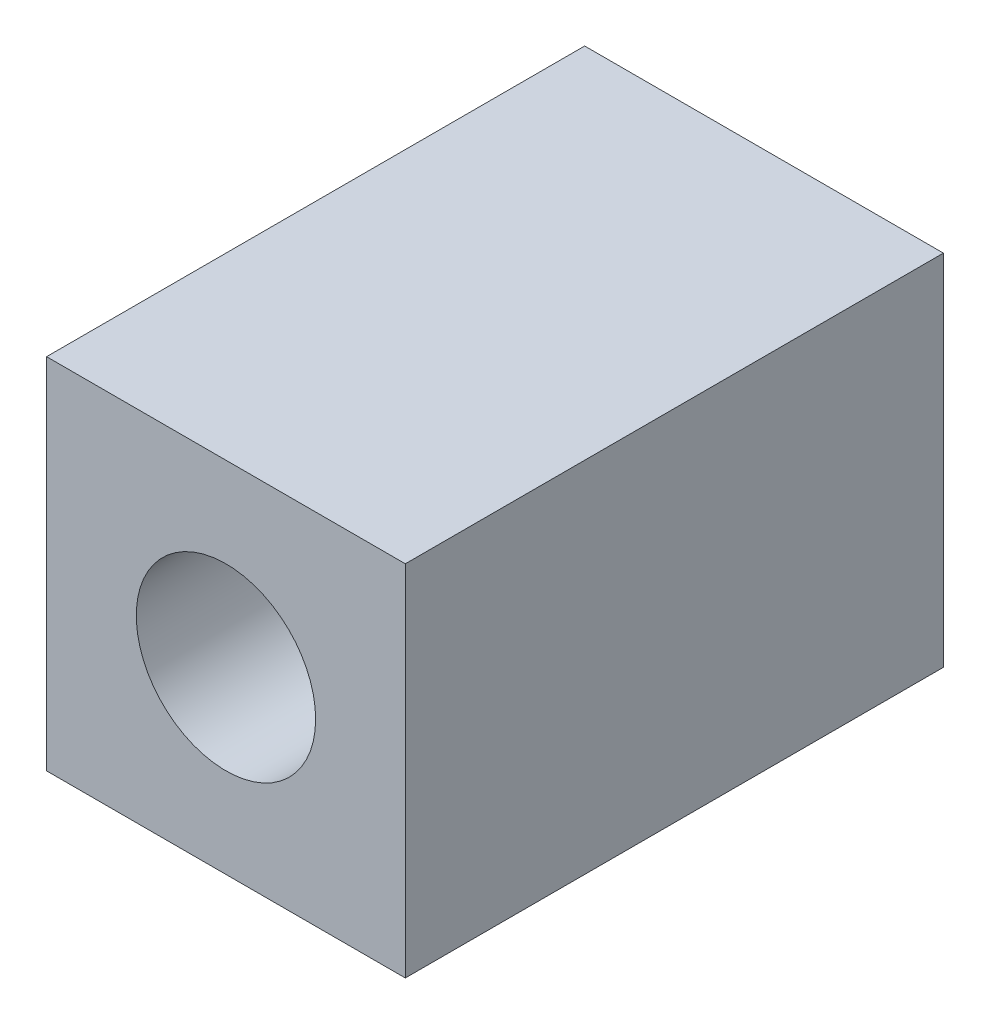
ISO-10303-21;
HEADER;
FILE_DESCRIPTION(('STEP AP214'),'2;1');
FILE_NAME('part.step','',(''),(''),'','','');
FILE_SCHEMA(('AUTOMOTIVE_DESIGN { 1 0 10303 214 1 1 1 1 }'));
ENDSEC;
DATA;
#1=APPLICATION_CONTEXT('core data for automotive mechanical design processes');
#2=APPLICATION_PROTOCOL_DEFINITION('international standard','automotive_design',2000,#1);
#3=PRODUCT_CONTEXT('',#1,'mechanical');
#4=PRODUCT('Part','Part','',(#3));
#5=PRODUCT_RELATED_PRODUCT_CATEGORY('part','',(#4));
#6=PRODUCT_DEFINITION_FORMATION('','',#4);
#7=PRODUCT_DEFINITION_CONTEXT('part definition',#1,'design');
#8=PRODUCT_DEFINITION('design','',#6,#7);
#9=PRODUCT_DEFINITION_SHAPE('','',#8);
#10=(LENGTH_UNIT() NAMED_UNIT(*) SI_UNIT(.MILLI.,.METRE.));
#11=(NAMED_UNIT(*) PLANE_ANGLE_UNIT() SI_UNIT($,.RADIAN.));
#12=(NAMED_UNIT(*) SI_UNIT($,.STERADIAN.) SOLID_ANGLE_UNIT());
#13=UNCERTAINTY_MEASURE_WITH_UNIT(LENGTH_MEASURE(1.E-05),#10,'distance_accuracy_value','');
#14=(GEOMETRIC_REPRESENTATION_CONTEXT(3) GLOBAL_UNCERTAINTY_ASSIGNED_CONTEXT((#13)) GLOBAL_UNIT_ASSIGNED_CONTEXT((#10,
#11,#12)) REPRESENTATION_CONTEXT('',''));
#15=CARTESIAN_POINT('',(0.,0.,0.));
#16=DIRECTION('',(0.,0.,1.));
#17=DIRECTION('',(1.,0.,0.));
#18=AXIS2_PLACEMENT_3D('',#15,#16,#17);
#19=CARTESIAN_POINT('',(-5.0000000000005,-5.00000000000061,15.0000000000003));
#20=DIRECTION('',(0.,0.,-1.00000000000001));
#21=DIRECTION('',(-1.00000000000001,0.,0.));
#22=AXIS2_PLACEMENT_3D('',#19,#20,#21);
#23=PLANE('',#22);
#24=DIRECTION('',(0.,-1.,0.));
#25=VECTOR('',#24,1.);
#26=CARTESIAN_POINT('',(-5.0000000000005,-5.00000000000061,15.0000000000003));
#27=LINE('',#26,#25);
#28=CARTESIAN_POINT('',(-5.,5.00000000000039,15.0000000000005));
#29=VERTEX_POINT('',#28);
#30=CARTESIAN_POINT('',(-5.0000000000005,-5.00000000000061,15.0000000000003));
#31=VERTEX_POINT('',#30);
#32=EDGE_CURVE('E95',#29,#31,#27,.T.);
#33=ORIENTED_EDGE('',*,*,#32,.T.);
#34=DIRECTION('',(1.00000000000001,0.,0.));
#35=VECTOR('',#34,1.);
#36=CARTESIAN_POINT('',(-5.0000000000005,-5.00000000000061,15.0000000000003));
#37=LINE('',#36,#35);
#38=CARTESIAN_POINT('',(5.00000000000014,-4.99999999999959,15.0000000000002));
#39=VERTEX_POINT('',#38);
#40=EDGE_CURVE('E98',#31,#39,#37,.T.);
#41=ORIENTED_EDGE('',*,*,#40,.T.);
#42=DIRECTION('',(0.,1.,0.));
#43=VECTOR('',#42,1.);
#44=CARTESIAN_POINT('',(5.00000000000014,-4.99999999999959,15.0000000000002));
#45=LINE('',#44,#43);
#46=CARTESIAN_POINT('',(4.99999999999923,5.00000000000042,15.0000000000005));
#47=VERTEX_POINT('',#46);
#48=EDGE_CURVE('E100',#39,#47,#45,.T.);
#49=ORIENTED_EDGE('',*,*,#48,.T.);
#50=DIRECTION('',(-1.00000000000001,0.,0.));
#51=VECTOR('',#50,1.);
#52=CARTESIAN_POINT('',(-5.,5.00000000000039,15.0000000000005));
#53=LINE('',#52,#51);
#54=EDGE_CURVE('E102',#47,#29,#53,.T.);
#55=ORIENTED_EDGE('',*,*,#54,.T.);
#56=EDGE_LOOP('',(#33,#41,#49,#55));
#57=FACE_BOUND('',#56,.T.);
#58=CARTESIAN_POINT('',(1.11022302462516E-13,-1.4432899320127E-12,15.0000000000019));
#59=DIRECTION('',(0.,0.,1.00000000000001));
#60=DIRECTION('',(1.00000000000001,0.,0.));
#61=AXIS2_PLACEMENT_3D('',#58,#59,#60);
#62=CIRCLE('',#61,2.5);
#63=CARTESIAN_POINT('',(2.50000000000014,-1.44324163284218E-12,15.0000000000019));
#64=VERTEX_POINT('',#63);
#65=EDGE_CURVE('E83',#64,#64,#62,.T.);
#66=ORIENTED_EDGE('',*,*,#65,.F.);
#67=EDGE_LOOP('',(#66));
#68=FACE_BOUND('',#67,.T.);
#69=ADVANCED_FACE('F16',(#57,#68),#23,.F.);
#70=CARTESIAN_POINT('',(-5.,-5.00000000000153,0.));
#71=DIRECTION('',(0.,0.,-1.00000000000001));
#72=DIRECTION('',(-1.00000000000001,0.,0.));
#73=AXIS2_PLACEMENT_3D('',#70,#71,#72);
#74=PLANE('',#73);
#75=DIRECTION('',(0.,-1.,0.));
#76=VECTOR('',#75,1.);
#77=CARTESIAN_POINT('',(-5.,-5.00000000000153,0.));
#78=LINE('',#77,#76);
#79=CARTESIAN_POINT('',(-5.0000000000002,4.99999999999848,1.56125112837913E-13));
#80=VERTEX_POINT('',#79);
#81=CARTESIAN_POINT('',(-5.,-5.00000000000153,0.));
#82=VERTEX_POINT('',#81);
#83=EDGE_CURVE('E86',#80,#82,#78,.T.);
#84=ORIENTED_EDGE('',*,*,#83,.F.);
#85=DIRECTION('',(-1.00000000000001,0.,0.));
#86=VECTOR('',#85,1.);
#87=CARTESIAN_POINT('',(-5.0000000000002,4.99999999999848,1.56125112837913E-13));
#88=LINE('',#87,#86);
#89=CARTESIAN_POINT('',(5.,5.00000000000037,6.10622663543836E-13));
#90=VERTEX_POINT('',#89);
#91=EDGE_CURVE('E93',#90,#80,#88,.T.);
#92=ORIENTED_EDGE('',*,*,#91,.F.);
#93=DIRECTION('',(0.,1.,0.));
#94=VECTOR('',#93,1.);
#95=CARTESIAN_POINT('',(5.,-5.0000000000015,1.35308431126191E-13));
#96=LINE('',#95,#94);
#97=CARTESIAN_POINT('',(5.,-5.0000000000015,1.35308431126191E-13));
#98=VERTEX_POINT('',#97);
#99=EDGE_CURVE('E91',#98,#90,#96,.T.);
#100=ORIENTED_EDGE('',*,*,#99,.F.);
#101=DIRECTION('',(1.00000000000001,0.,0.));
#102=VECTOR('',#101,1.);
#103=CARTESIAN_POINT('',(-5.,-5.00000000000153,0.));
#104=LINE('',#103,#102);
#105=EDGE_CURVE('E89',#82,#98,#104,.T.);
#106=ORIENTED_EDGE('',*,*,#105,.F.);
#107=EDGE_LOOP('',(#84,#92,#100,#106));
#108=FACE_BOUND('',#107,.T.);
#109=CARTESIAN_POINT('',(0.,-1.11022302462516E-13,4.96130914129367E-13));
#110=DIRECTION('',(0.,0.,1.00000000000001));
#111=DIRECTION('',(1.00000000000001,0.,0.));
#112=AXIS2_PLACEMENT_3D('',#109,#110,#111);
#113=CIRCLE('',#112,2.5);
#114=CARTESIAN_POINT('',(2.50000000000003,-1.10974003291995E-13,5.27909964007082E-13));
#115=VERTEX_POINT('',#114);
#116=EDGE_CURVE('E77',#115,#115,#113,.T.);
#117=ORIENTED_EDGE('',*,*,#116,.T.);
#118=EDGE_LOOP('',(#117));
#119=FACE_BOUND('',#118,.T.);
#120=ADVANCED_FACE('F126',(#108,#119),#74,.T.);
#121=CARTESIAN_POINT('',(-5.0000000000005,-5.00000000000061,15.0000000000003));
#122=DIRECTION('',(1.00000000000001,0.,0.));
#123=DIRECTION('',(0.,0.,-1.00000000000001));
#124=AXIS2_PLACEMENT_3D('',#121,#122,#123);
#125=PLANE('',#124);
#126=CARTESIAN_POINT('',(-4.99999999999938,-1.36002320516582E-12,4.99999999999881));
#127=DIRECTION('',(1.00000000000001,0.,0.));
#128=DIRECTION('',(0.,0.,-1.00000000000001));
#129=AXIS2_PLACEMENT_3D('',#126,#127,#128);
#130=CIRCLE('',#129,2.5);
#131=CARTESIAN_POINT('',(-4.99999999999942,-1.36471563216833E-12,2.49999999999878));
#132=VERTEX_POINT('',#131);
#133=EDGE_CURVE('E74',#132,#132,#130,.T.);
#134=ORIENTED_EDGE('',*,*,#133,.T.);
#135=EDGE_LOOP('',(#134));
#136=FACE_BOUND('',#135,.T.);
#137=ORIENTED_EDGE('',*,*,#83,.T.);
#138=DIRECTION('',(0.,0.,-1.00000000000001));
#139=VECTOR('',#138,1.);
#140=CARTESIAN_POINT('',(-5.0000000000005,-5.00000000000061,15.0000000000003));
#141=LINE('',#140,#139);
#142=EDGE_CURVE('E113',#31,#82,#141,.T.);
#143=ORIENTED_EDGE('',*,*,#142,.F.);
#144=ORIENTED_EDGE('',*,*,#32,.F.);
#145=DIRECTION('',(0.,0.,-1.00000000000001));
#146=VECTOR('',#145,1.);
#147=CARTESIAN_POINT('',(-5.,5.00000000000039,15.0000000000005));
#148=LINE('',#147,#146);
#149=EDGE_CURVE('E104',#29,#80,#148,.T.);
#150=ORIENTED_EDGE('',*,*,#149,.T.);
#151=EDGE_LOOP('',(#137,#143,#144,#150));
#152=FACE_BOUND('',#151,.T.);
#153=ADVANCED_FACE('F18',(#136,#152),#125,.F.);
#154=CARTESIAN_POINT('',(-5.0000000000005,-5.00000000000061,15.0000000000003));
#155=DIRECTION('',(0.,1.,0.));
#156=DIRECTION('',(0.,0.,1.00000000000001));
#157=AXIS2_PLACEMENT_3D('',#154,#155,#156);
#158=PLANE('',#157);
#159=CARTESIAN_POINT('',(1.2490009027033E-13,-5.0000000000012,5.00000000000087));
#160=DIRECTION('',(0.,1.,0.));
#161=DIRECTION('',(0.,0.,1.00000000000001));
#162=AXIS2_PLACEMENT_3D('',#159,#160,#161);
#163=CIRCLE('',#162,2.5);
#164=CARTESIAN_POINT('',(1.62926855166992E-13,-5.00000000000119,7.5000000000009));
#165=VERTEX_POINT('',#164);
#166=EDGE_CURVE('E70',#165,#165,#163,.T.);
#167=ORIENTED_EDGE('',*,*,#166,.T.);
#168=EDGE_LOOP('',(#167));
#169=FACE_BOUND('',#168,.T.);
#170=ORIENTED_EDGE('',*,*,#105,.T.);
#171=DIRECTION('',(0.,0.,-1.00000000000001));
#172=VECTOR('',#171,1.);
#173=CARTESIAN_POINT('',(5.00000000000014,-4.99999999999959,15.0000000000002));
#174=LINE('',#173,#172);
#175=EDGE_CURVE('E110',#39,#98,#174,.T.);
#176=ORIENTED_EDGE('',*,*,#175,.F.);
#177=ORIENTED_EDGE('',*,*,#40,.F.);
#178=ORIENTED_EDGE('',*,*,#142,.T.);
#179=EDGE_LOOP('',(#170,#176,#177,#178));
#180=FACE_BOUND('',#179,.T.);
#181=ADVANCED_FACE('F125',(#169,#180),#158,.F.);
#182=CARTESIAN_POINT('',(5.00000000000014,-4.99999999999959,15.0000000000002));
#183=DIRECTION('',(-1.00000000000001,0.,0.));
#184=DIRECTION('',(0.,0.,1.00000000000001));
#185=AXIS2_PLACEMENT_3D('',#182,#183,#184);
#186=PLANE('',#185);
#187=ORIENTED_EDGE('',*,*,#99,.T.);
#188=DIRECTION('',(0.,0.,-1.00000000000001));
#189=VECTOR('',#188,1.);
#190=CARTESIAN_POINT('',(4.99999999999923,5.00000000000042,15.0000000000005));
#191=LINE('',#190,#189);
#192=EDGE_CURVE('E107',#47,#90,#191,.T.);
#193=ORIENTED_EDGE('',*,*,#192,.F.);
#194=ORIENTED_EDGE('',*,*,#48,.F.);
#195=ORIENTED_EDGE('',*,*,#175,.T.);
#196=EDGE_LOOP('',(#187,#193,#194,#195));
#197=FACE_BOUND('',#196,.T.);
#198=ADVANCED_FACE('F145',(#197),#186,.F.);
#199=CARTESIAN_POINT('',(-5.,5.00000000000039,15.0000000000005));
#200=DIRECTION('',(0.,-1.,0.));
#201=DIRECTION('',(1.00000000000001,0.,0.));
#202=AXIS2_PLACEMENT_3D('',#199,#200,#201);
#203=PLANE('',#202);
#204=ORIENTED_EDGE('',*,*,#91,.T.);
#205=ORIENTED_EDGE('',*,*,#149,.F.);
#206=ORIENTED_EDGE('',*,*,#54,.F.);
#207=ORIENTED_EDGE('',*,*,#192,.T.);
#208=EDGE_LOOP('',(#204,#205,#206,#207));
#209=FACE_BOUND('',#208,.T.);
#210=ADVANCED_FACE('F143',(#209),#203,.F.);
#211=CARTESIAN_POINT('',(1.11022302462516E-13,-1.4432899320127E-12,15.0000000000019));
#212=DIRECTION('',(0.,0.,-1.00000000000001));
#213=DIRECTION('',(-1.00000000000001,0.,0.));
#214=AXIS2_PLACEMENT_3D('',#211,#212,#213);
#215=CYLINDRICAL_SURFACE('',#214,2.5);
#216=CARTESIAN_POINT('',(7.07767178198537E-13,6.10622663543836E-13,5.00000000000177));
#217=DIRECTION('',(0.,0.707106781186549,-0.707106781186557));
#218=DIRECTION('',(0.,-0.707106781186548,-0.707106781186557));
#219=AXIS2_PLACEMENT_3D('',#216,#217,#218);
#220=ELLIPSE('',#219,3.53553390593274,2.5);
#221=CARTESIAN_POINT('',(2.49999999999925,-9.99200722162641E-13,5.00000000000005));
#222=VERTEX_POINT('',#221);
#223=CARTESIAN_POINT('',(-1.76776695296632,-1.76776695296785,3.23223304703495));
#224=VERTEX_POINT('',#223);
#225=EDGE_CURVE('E31',#222,#224,#220,.T.);
#226=ORIENTED_EDGE('',*,*,#225,.F.);
#227=CARTESIAN_POINT('',(7.07767178198537E-13,6.10622663543836E-13,5.00000000000177));
#228=DIRECTION('',(0.,-0.707106781186548,-0.707106781186557));
#229=DIRECTION('',(0.,0.707106781186549,-0.707106781186557));
#230=AXIS2_PLACEMENT_3D('',#227,#228,#229);
#231=ELLIPSE('',#230,3.53553390593274,2.5);
#232=CARTESIAN_POINT('',(-1.76776695296554,-1.76776695296599,6.76776695296371));
#233=VERTEX_POINT('',#232);
#234=EDGE_CURVE('E66',#233,#222,#231,.F.);
#235=ORIENTED_EDGE('',*,*,#234,.F.);
#236=CARTESIAN_POINT('',(7.07767178198537E-13,6.10622663543836E-13,5.00000000000177));
#237=DIRECTION('',(-0.707106781186569,0.,-0.707106781186567));
#238=DIRECTION('',(0.707106781186552,0.,-0.707106781186544));
#239=AXIS2_PLACEMENT_3D('',#236,#237,#238);
#240=ELLIPSE('',#239,3.53553390593274,2.5);
#241=CARTESIAN_POINT('',(6.80011602582908E-13,2.49999999999861,5.00000000000185));
#242=VERTEX_POINT('',#241);
#243=EDGE_CURVE('E116',#242,#233,#240,.F.);
#244=ORIENTED_EDGE('',*,*,#243,.F.);
#245=CARTESIAN_POINT('',(7.07767178198537E-13,6.10622663543836E-13,5.00000000000177));
#246=DIRECTION('',(0.707106781186552,0.,-0.707106781186544));
#247=DIRECTION('',(-0.707106781186569,0.,-0.707106781186567));
#248=AXIS2_PLACEMENT_3D('',#245,#246,#247);
#249=ELLIPSE('',#248,3.53553390593274,2.5);
#250=EDGE_CURVE('E24',#224,#242,#249,.T.);
#251=ORIENTED_EDGE('',*,*,#250,.F.);
#252=EDGE_LOOP('',(#226,#235,#244,#251));
#253=FACE_BOUND('',#252,.T.);
#254=ORIENTED_EDGE('',*,*,#65,.T.);
#255=EDGE_LOOP('',(#254));
#256=FACE_BOUND('',#255,.T.);
#257=ORIENTED_EDGE('',*,*,#116,.F.);
#258=EDGE_LOOP('',(#257));
#259=FACE_BOUND('',#258,.T.);
#260=ADVANCED_FACE('F72',(#253,#256,#259),#215,.F.);
#261=CARTESIAN_POINT('',(-4.99999999999938,-1.36002320516582E-12,4.99999999999881));
#262=DIRECTION('',(1.00000000000001,0.,0.));
#263=DIRECTION('',(0.,0.,-1.00000000000001));
#264=AXIS2_PLACEMENT_3D('',#261,#262,#263);
#265=CYLINDRICAL_SURFACE('',#264,2.5);
#266=ORIENTED_EDGE('',*,*,#243,.T.);
#267=CARTESIAN_POINT('',(7.07767178198537E-13,6.10622663543836E-13,5.00000000000177));
#268=DIRECTION('',(0.707106781186561,-0.707106781186545,0.));
#269=DIRECTION('',(0.707106781186561,0.707106781186557,0.));
#270=AXIS2_PLACEMENT_3D('',#267,#268,#269);
#271=ELLIPSE('',#270,3.53553390593274,2.5);
#272=EDGE_CURVE('E11',#233,#224,#271,.T.);
#273=ORIENTED_EDGE('',*,*,#272,.T.);
#274=ORIENTED_EDGE('',*,*,#250,.T.);
#275=EDGE_LOOP('',(#266,#273,#274));
#276=FACE_BOUND('',#275,.T.);
#277=ORIENTED_EDGE('',*,*,#133,.F.);
#278=EDGE_LOOP('',(#277));
#279=FACE_BOUND('',#278,.T.);
#280=ADVANCED_FACE('F117',(#276,#279),#265,.F.);
#281=CARTESIAN_POINT('',(1.2490009027033E-13,-5.0000000000012,5.00000000000087));
#282=DIRECTION('',(0.,1.,0.));
#283=DIRECTION('',(0.,0.,1.00000000000001));
#284=AXIS2_PLACEMENT_3D('',#281,#282,#283);
#285=CYLINDRICAL_SURFACE('',#284,2.5);
#286=ORIENTED_EDGE('',*,*,#225,.T.);
#287=ORIENTED_EDGE('',*,*,#272,.F.);
#288=ORIENTED_EDGE('',*,*,#234,.T.);
#289=EDGE_LOOP('',(#286,#287,#288));
#290=FACE_BOUND('',#289,.T.);
#291=ORIENTED_EDGE('',*,*,#166,.F.);
#292=EDGE_LOOP('',(#291));
#293=FACE_BOUND('',#292,.T.);
#294=ADVANCED_FACE('F67',(#290,#293),#285,.F.);
#295=CLOSED_SHELL('',(#69,#120,#153,#181,#198,#210,#260,#280,#294));
#296=MANIFOLD_SOLID_BREP('B1',#295);
#297=ADVANCED_BREP_SHAPE_REPRESENTATION('',(#18,#296),#14);
#298=SHAPE_DEFINITION_REPRESENTATION(#9,#297);
ENDSEC;
END-ISO-10303-21;
